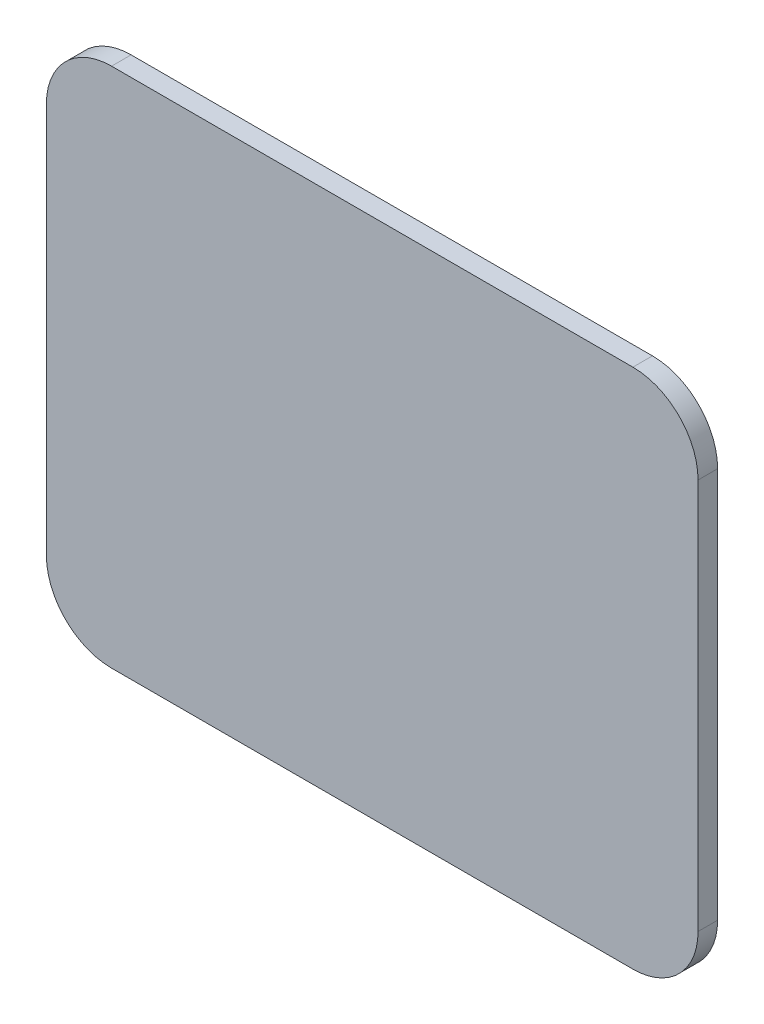
ISO-10303-21;
HEADER;
FILE_DESCRIPTION(('STEP AP214'),'2;1');
FILE_NAME('part.step','',(''),(''),'','','');
FILE_SCHEMA(('AUTOMOTIVE_DESIGN { 1 0 10303 214 1 1 1 1 }'));
ENDSEC;
DATA;
#1=APPLICATION_CONTEXT('core data for automotive mechanical design processes');
#2=APPLICATION_PROTOCOL_DEFINITION('international standard','automotive_design',2000,#1);
#3=PRODUCT_CONTEXT('',#1,'mechanical');
#4=PRODUCT('Part','Part','',(#3));
#5=PRODUCT_RELATED_PRODUCT_CATEGORY('part','',(#4));
#6=PRODUCT_DEFINITION_FORMATION('','',#4);
#7=PRODUCT_DEFINITION_CONTEXT('part definition',#1,'design');
#8=PRODUCT_DEFINITION('design','',#6,#7);
#9=PRODUCT_DEFINITION_SHAPE('','',#8);
#10=(LENGTH_UNIT() NAMED_UNIT(*) SI_UNIT(.MILLI.,.METRE.));
#11=(NAMED_UNIT(*) PLANE_ANGLE_UNIT() SI_UNIT($,.RADIAN.));
#12=(NAMED_UNIT(*) SI_UNIT($,.STERADIAN.) SOLID_ANGLE_UNIT());
#13=UNCERTAINTY_MEASURE_WITH_UNIT(LENGTH_MEASURE(1.E-05),#10,'distance_accuracy_value','');
#14=(GEOMETRIC_REPRESENTATION_CONTEXT(3) GLOBAL_UNCERTAINTY_ASSIGNED_CONTEXT((#13)) GLOBAL_UNIT_ASSIGNED_CONTEXT((#10,
#11,#12)) REPRESENTATION_CONTEXT('',''));
#15=CARTESIAN_POINT('',(0.,0.,0.));
#16=DIRECTION('',(0.,0.,1.));
#17=DIRECTION('',(1.,0.,0.));
#18=AXIS2_PLACEMENT_3D('',#15,#16,#17);
#19=CARTESIAN_POINT('',(90.,70.,3.));
#20=DIRECTION('',(0.,0.,-1.));
#21=DIRECTION('',(-1.,0.,0.));
#22=AXIS2_PLACEMENT_3D('',#19,#20,#21);
#23=CYLINDRICAL_SURFACE('',#22,9.99999999999999);
#24=CARTESIAN_POINT('',(90.,70.,0.));
#25=DIRECTION('',(0.,0.,1.));
#26=DIRECTION('',(-1.,0.,0.));
#27=AXIS2_PLACEMENT_3D('',#24,#25,#26);
#28=CIRCLE('',#27,9.99999999999999);
#29=CARTESIAN_POINT('',(100.,69.9999999999999,0.));
#30=VERTEX_POINT('',#29);
#31=CARTESIAN_POINT('',(89.9999999999999,80.,0.));
#32=VERTEX_POINT('',#31);
#33=EDGE_CURVE('E130',#30,#32,#28,.T.);
#34=ORIENTED_EDGE('',*,*,#33,.T.);
#35=DIRECTION('',(0.,0.,-1.));
#36=VECTOR('',#35,1.);
#37=CARTESIAN_POINT('',(89.9999999999999,80.,3.));
#38=LINE('',#37,#36);
#39=CARTESIAN_POINT('',(89.9999999999999,80.,3.));
#40=VERTEX_POINT('',#39);
#41=EDGE_CURVE('E11',#40,#32,#38,.T.);
#42=ORIENTED_EDGE('',*,*,#41,.F.);
#43=CARTESIAN_POINT('',(90.,70.,3.));
#44=DIRECTION('',(0.,0.,1.));
#45=DIRECTION('',(-1.,0.,0.));
#46=AXIS2_PLACEMENT_3D('',#43,#44,#45);
#47=CIRCLE('',#46,9.99999999999999);
#48=CARTESIAN_POINT('',(100.,69.9999999999999,3.));
#49=VERTEX_POINT('',#48);
#50=EDGE_CURVE('E144',#49,#40,#47,.T.);
#51=ORIENTED_EDGE('',*,*,#50,.F.);
#52=DIRECTION('',(0.,0.,-1.));
#53=VECTOR('',#52,1.);
#54=CARTESIAN_POINT('',(100.,69.9999999999999,3.));
#55=LINE('',#54,#53);
#56=EDGE_CURVE('E126',#49,#30,#55,.T.);
#57=ORIENTED_EDGE('',*,*,#56,.T.);
#58=EDGE_LOOP('',(#34,#42,#51,#57));
#59=FACE_BOUND('',#58,.T.);
#60=ADVANCED_FACE('F34',(#59),#23,.T.);
#61=CARTESIAN_POINT('',(10.0000000000001,80.,3.));
#62=DIRECTION('',(0.,-1.,0.));
#63=DIRECTION('',(0.,0.,-1.));
#64=AXIS2_PLACEMENT_3D('',#61,#62,#63);
#65=PLANE('',#64);
#66=DIRECTION('',(-1.,0.,0.));
#67=VECTOR('',#66,1.);
#68=CARTESIAN_POINT('',(10.0000000000001,80.,0.));
#69=LINE('',#68,#67);
#70=CARTESIAN_POINT('',(10.0000000000001,80.,0.));
#71=VERTEX_POINT('',#70);
#72=EDGE_CURVE('E133',#32,#71,#69,.T.);
#73=ORIENTED_EDGE('',*,*,#72,.T.);
#74=DIRECTION('',(0.,0.,-1.));
#75=VECTOR('',#74,1.);
#76=CARTESIAN_POINT('',(10.0000000000001,80.,3.));
#77=LINE('',#76,#75);
#78=CARTESIAN_POINT('',(10.0000000000001,80.,3.));
#79=VERTEX_POINT('',#78);
#80=EDGE_CURVE('E42',#79,#71,#77,.T.);
#81=ORIENTED_EDGE('',*,*,#80,.F.);
#82=DIRECTION('',(-1.,0.,0.));
#83=VECTOR('',#82,1.);
#84=CARTESIAN_POINT('',(10.0000000000001,80.,3.));
#85=LINE('',#84,#83);
#86=EDGE_CURVE('E93',#40,#79,#85,.T.);
#87=ORIENTED_EDGE('',*,*,#86,.F.);
#88=ORIENTED_EDGE('',*,*,#41,.T.);
#89=EDGE_LOOP('',(#73,#81,#87,#88));
#90=FACE_BOUND('',#89,.T.);
#91=ADVANCED_FACE('F179',(#90),#65,.F.);
#92=CARTESIAN_POINT('',(10.,70.,3.));
#93=DIRECTION('',(0.,0.,-1.));
#94=DIRECTION('',(-1.,0.,0.));
#95=AXIS2_PLACEMENT_3D('',#92,#93,#94);
#96=CYLINDRICAL_SURFACE('',#95,10.);
#97=CARTESIAN_POINT('',(10.,70.,0.));
#98=DIRECTION('',(0.,0.,1.));
#99=DIRECTION('',(-1.,0.,0.));
#100=AXIS2_PLACEMENT_3D('',#97,#98,#99);
#101=CIRCLE('',#100,10.);
#102=CARTESIAN_POINT('',(0.,69.9999999999999,0.));
#103=VERTEX_POINT('',#102);
#104=EDGE_CURVE('E135',#71,#103,#101,.T.);
#105=ORIENTED_EDGE('',*,*,#104,.T.);
#106=DIRECTION('',(0.,0.,-1.));
#107=VECTOR('',#106,1.);
#108=CARTESIAN_POINT('',(0.,69.9999999999999,3.));
#109=LINE('',#108,#107);
#110=CARTESIAN_POINT('',(0.,69.9999999999999,3.));
#111=VERTEX_POINT('',#110);
#112=EDGE_CURVE('E151',#111,#103,#109,.T.);
#113=ORIENTED_EDGE('',*,*,#112,.F.);
#114=CARTESIAN_POINT('',(10.,70.,3.));
#115=DIRECTION('',(0.,0.,1.));
#116=DIRECTION('',(-1.,0.,0.));
#117=AXIS2_PLACEMENT_3D('',#114,#115,#116);
#118=CIRCLE('',#117,10.);
#119=EDGE_CURVE('E159',#79,#111,#118,.T.);
#120=ORIENTED_EDGE('',*,*,#119,.F.);
#121=ORIENTED_EDGE('',*,*,#80,.T.);
#122=EDGE_LOOP('',(#105,#113,#120,#121));
#123=FACE_BOUND('',#122,.T.);
#124=ADVANCED_FACE('F157',(#123),#96,.T.);
#125=CARTESIAN_POINT('',(0.,10.0000000000001,3.));
#126=DIRECTION('',(1.,0.,0.));
#127=DIRECTION('',(0.,0.,-1.));
#128=AXIS2_PLACEMENT_3D('',#125,#126,#127);
#129=PLANE('',#128);
#130=DIRECTION('',(0.,-1.,0.));
#131=VECTOR('',#130,1.);
#132=CARTESIAN_POINT('',(0.,10.0000000000001,0.));
#133=LINE('',#132,#131);
#134=CARTESIAN_POINT('',(0.,10.0000000000001,0.));
#135=VERTEX_POINT('',#134);
#136=EDGE_CURVE('E137',#103,#135,#133,.T.);
#137=ORIENTED_EDGE('',*,*,#136,.T.);
#138=DIRECTION('',(0.,0.,-1.));
#139=VECTOR('',#138,1.);
#140=CARTESIAN_POINT('',(0.,10.0000000000001,3.));
#141=LINE('',#140,#139);
#142=CARTESIAN_POINT('',(0.,10.0000000000001,3.));
#143=VERTEX_POINT('',#142);
#144=EDGE_CURVE('E148',#143,#135,#141,.T.);
#145=ORIENTED_EDGE('',*,*,#144,.F.);
#146=DIRECTION('',(0.,-1.,0.));
#147=VECTOR('',#146,1.);
#148=CARTESIAN_POINT('',(0.,10.0000000000001,3.));
#149=LINE('',#148,#147);
#150=EDGE_CURVE('E171',#111,#143,#149,.T.);
#151=ORIENTED_EDGE('',*,*,#150,.F.);
#152=ORIENTED_EDGE('',*,*,#112,.T.);
#153=EDGE_LOOP('',(#137,#145,#151,#152));
#154=FACE_BOUND('',#153,.T.);
#155=ADVANCED_FACE('F167',(#154),#129,.F.);
#156=CARTESIAN_POINT('',(10.,10.,3.));
#157=DIRECTION('',(0.,0.,-1.));
#158=DIRECTION('',(-1.,0.,0.));
#159=AXIS2_PLACEMENT_3D('',#156,#157,#158);
#160=CYLINDRICAL_SURFACE('',#159,10.);
#161=CARTESIAN_POINT('',(10.,10.,0.));
#162=DIRECTION('',(0.,0.,1.));
#163=DIRECTION('',(-1.,0.,0.));
#164=AXIS2_PLACEMENT_3D('',#161,#162,#163);
#165=CIRCLE('',#164,10.);
#166=CARTESIAN_POINT('',(10.0000000000001,0.,0.));
#167=VERTEX_POINT('',#166);
#168=EDGE_CURVE('E139',#135,#167,#165,.T.);
#169=ORIENTED_EDGE('',*,*,#168,.T.);
#170=DIRECTION('',(0.,0.,-1.));
#171=VECTOR('',#170,1.);
#172=CARTESIAN_POINT('',(10.0000000000001,0.,3.));
#173=LINE('',#172,#171);
#174=CARTESIAN_POINT('',(10.0000000000001,0.,3.));
#175=VERTEX_POINT('',#174);
#176=EDGE_CURVE('E121',#175,#167,#173,.T.);
#177=ORIENTED_EDGE('',*,*,#176,.F.);
#178=CARTESIAN_POINT('',(10.,10.,3.));
#179=DIRECTION('',(0.,0.,1.));
#180=DIRECTION('',(-1.,0.,0.));
#181=AXIS2_PLACEMENT_3D('',#178,#179,#180);
#182=CIRCLE('',#181,10.);
#183=EDGE_CURVE('E112',#143,#175,#182,.T.);
#184=ORIENTED_EDGE('',*,*,#183,.F.);
#185=ORIENTED_EDGE('',*,*,#144,.T.);
#186=EDGE_LOOP('',(#169,#177,#184,#185));
#187=FACE_BOUND('',#186,.T.);
#188=ADVANCED_FACE('F170',(#187),#160,.T.);
#189=CARTESIAN_POINT('',(10.0000000000001,0.,3.));
#190=DIRECTION('',(0.,1.,0.));
#191=DIRECTION('',(0.,0.,1.));
#192=AXIS2_PLACEMENT_3D('',#189,#190,#191);
#193=PLANE('',#192);
#194=DIRECTION('',(1.,0.,0.));
#195=VECTOR('',#194,1.);
#196=CARTESIAN_POINT('',(10.0000000000001,0.,0.));
#197=LINE('',#196,#195);
#198=CARTESIAN_POINT('',(89.9999999999999,0.,0.));
#199=VERTEX_POINT('',#198);
#200=EDGE_CURVE('E120',#167,#199,#197,.T.);
#201=ORIENTED_EDGE('',*,*,#200,.T.);
#202=DIRECTION('',(0.,0.,-1.));
#203=VECTOR('',#202,1.);
#204=CARTESIAN_POINT('',(89.9999999999999,0.,3.));
#205=LINE('',#204,#203);
#206=CARTESIAN_POINT('',(89.9999999999999,0.,3.));
#207=VERTEX_POINT('',#206);
#208=EDGE_CURVE('E117',#207,#199,#205,.T.);
#209=ORIENTED_EDGE('',*,*,#208,.F.);
#210=DIRECTION('',(1.,0.,0.));
#211=VECTOR('',#210,1.);
#212=CARTESIAN_POINT('',(10.0000000000001,0.,3.));
#213=LINE('',#212,#211);
#214=EDGE_CURVE('E106',#175,#207,#213,.T.);
#215=ORIENTED_EDGE('',*,*,#214,.F.);
#216=ORIENTED_EDGE('',*,*,#176,.T.);
#217=EDGE_LOOP('',(#201,#209,#215,#216));
#218=FACE_BOUND('',#217,.T.);
#219=ADVANCED_FACE('F118',(#218),#193,.F.);
#220=CARTESIAN_POINT('',(90.,10.,3.));
#221=DIRECTION('',(0.,0.,-1.));
#222=DIRECTION('',(-1.,0.,0.));
#223=AXIS2_PLACEMENT_3D('',#220,#221,#222);
#224=CYLINDRICAL_SURFACE('',#223,10.);
#225=CARTESIAN_POINT('',(90.,10.,0.));
#226=DIRECTION('',(0.,0.,1.));
#227=DIRECTION('',(1.,0.,0.));
#228=AXIS2_PLACEMENT_3D('',#225,#226,#227);
#229=CIRCLE('',#228,10.);
#230=CARTESIAN_POINT('',(100.,10.,0.));
#231=VERTEX_POINT('',#230);
#232=EDGE_CURVE('E79',#199,#231,#229,.T.);
#233=ORIENTED_EDGE('',*,*,#232,.T.);
#234=DIRECTION('',(0.,0.,-1.));
#235=VECTOR('',#234,1.);
#236=CARTESIAN_POINT('',(100.,10.,3.));
#237=LINE('',#236,#235);
#238=CARTESIAN_POINT('',(100.,10.,3.));
#239=VERTEX_POINT('',#238);
#240=EDGE_CURVE('E122',#239,#231,#237,.T.);
#241=ORIENTED_EDGE('',*,*,#240,.F.);
#242=CARTESIAN_POINT('',(90.,10.,3.));
#243=DIRECTION('',(0.,0.,1.));
#244=DIRECTION('',(1.,0.,0.));
#245=AXIS2_PLACEMENT_3D('',#242,#243,#244);
#246=CIRCLE('',#245,10.);
#247=EDGE_CURVE('E110',#207,#239,#246,.T.);
#248=ORIENTED_EDGE('',*,*,#247,.F.);
#249=ORIENTED_EDGE('',*,*,#208,.T.);
#250=EDGE_LOOP('',(#233,#241,#248,#249));
#251=FACE_BOUND('',#250,.T.);
#252=ADVANCED_FACE('F124',(#251),#224,.T.);
#253=CARTESIAN_POINT('',(100.,10.0000000000001,3.));
#254=DIRECTION('',(-1.,0.,0.));
#255=DIRECTION('',(0.,0.,1.));
#256=AXIS2_PLACEMENT_3D('',#253,#254,#255);
#257=PLANE('',#256);
#258=DIRECTION('',(0.,1.,0.));
#259=VECTOR('',#258,1.);
#260=CARTESIAN_POINT('',(100.,10.0000000000001,0.));
#261=LINE('',#260,#259);
#262=EDGE_CURVE('E85',#231,#30,#261,.T.);
#263=ORIENTED_EDGE('',*,*,#262,.T.);
#264=ORIENTED_EDGE('',*,*,#56,.F.);
#265=DIRECTION('',(0.,1.,0.));
#266=VECTOR('',#265,1.);
#267=CARTESIAN_POINT('',(100.,10.0000000000001,3.));
#268=LINE('',#267,#266);
#269=EDGE_CURVE('E50',#239,#49,#268,.T.);
#270=ORIENTED_EDGE('',*,*,#269,.F.);
#271=ORIENTED_EDGE('',*,*,#240,.T.);
#272=EDGE_LOOP('',(#263,#264,#270,#271));
#273=FACE_BOUND('',#272,.T.);
#274=ADVANCED_FACE('F195',(#273),#257,.F.);
#275=CARTESIAN_POINT('',(90.,70.,3.));
#276=DIRECTION('',(0.,0.,-1.));
#277=DIRECTION('',(-1.,0.,0.));
#278=AXIS2_PLACEMENT_3D('',#275,#276,#277);
#279=PLANE('',#278);
#280=ORIENTED_EDGE('',*,*,#50,.T.);
#281=ORIENTED_EDGE('',*,*,#86,.T.);
#282=ORIENTED_EDGE('',*,*,#119,.T.);
#283=ORIENTED_EDGE('',*,*,#150,.T.);
#284=ORIENTED_EDGE('',*,*,#183,.T.);
#285=ORIENTED_EDGE('',*,*,#214,.T.);
#286=ORIENTED_EDGE('',*,*,#247,.T.);
#287=ORIENTED_EDGE('',*,*,#269,.T.);
#288=EDGE_LOOP('',(#280,#281,#282,#283,#284,#285,#286,#287));
#289=FACE_BOUND('',#288,.T.);
#290=ADVANCED_FACE('F108',(#289),#279,.F.);
#291=CARTESIAN_POINT('',(90.,70.,0.));
#292=DIRECTION('',(0.,0.,-1.));
#293=DIRECTION('',(-1.,0.,0.));
#294=AXIS2_PLACEMENT_3D('',#291,#292,#293);
#295=PLANE('',#294);
#296=ORIENTED_EDGE('',*,*,#33,.F.);
#297=ORIENTED_EDGE('',*,*,#262,.F.);
#298=ORIENTED_EDGE('',*,*,#232,.F.);
#299=ORIENTED_EDGE('',*,*,#200,.F.);
#300=ORIENTED_EDGE('',*,*,#168,.F.);
#301=ORIENTED_EDGE('',*,*,#136,.F.);
#302=ORIENTED_EDGE('',*,*,#104,.F.);
#303=ORIENTED_EDGE('',*,*,#72,.F.);
#304=EDGE_LOOP('',(#296,#297,#298,#299,#300,#301,#302,#303));
#305=FACE_BOUND('',#304,.T.);
#306=ADVANCED_FACE('F163',(#305),#295,.T.);
#307=CLOSED_SHELL('',(#60,#91,#124,#155,#188,#219,#252,#274,#290,#306));
#308=MANIFOLD_SOLID_BREP('B2',#307);
#309=ADVANCED_BREP_SHAPE_REPRESENTATION('',(#18,#308),#14);
#310=SHAPE_DEFINITION_REPRESENTATION(#9,#309);
ENDSEC;
END-ISO-10303-21;
